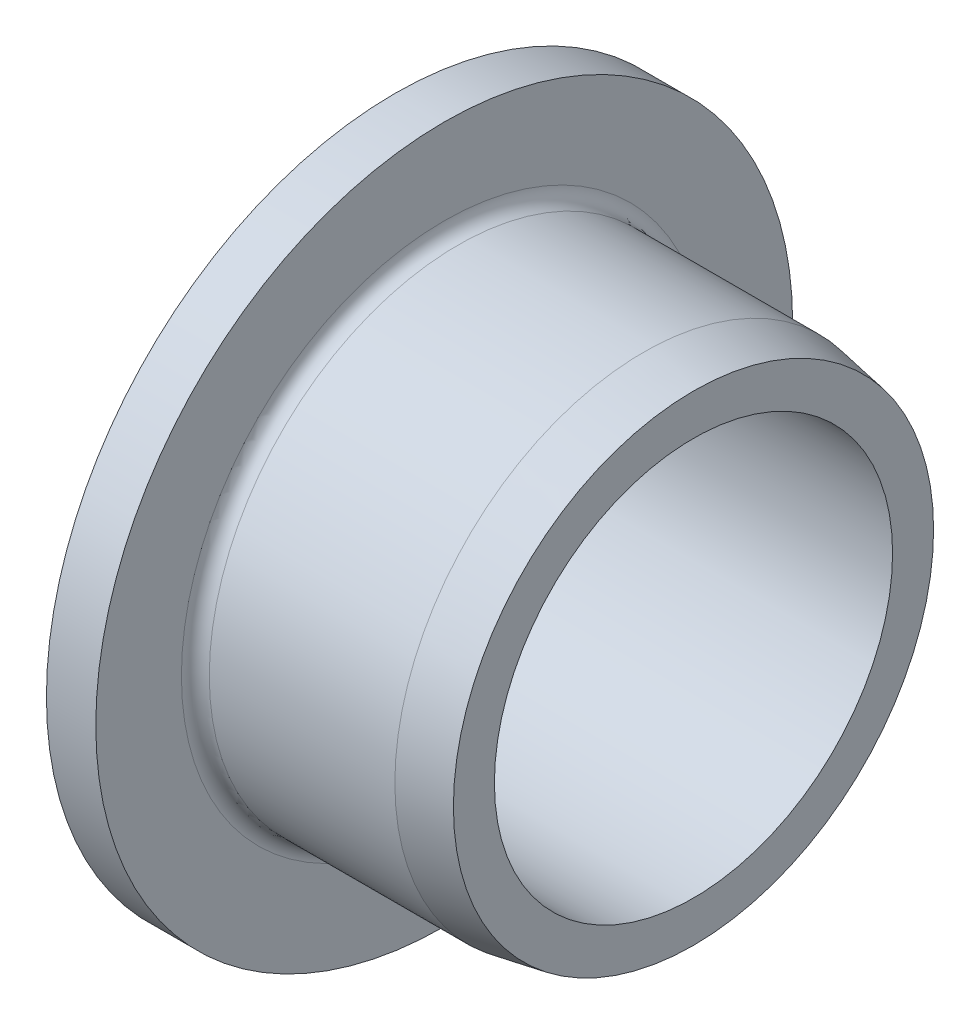
ISO-10303-21;
HEADER;
FILE_DESCRIPTION(('STEP AP214'),'2;1');
FILE_NAME('part.step','',(''),(''),'','','');
FILE_SCHEMA(('AUTOMOTIVE_DESIGN { 1 0 10303 214 1 1 1 1 }'));
ENDSEC;
DATA;
#1=APPLICATION_CONTEXT('core data for automotive mechanical design processes');
#2=APPLICATION_PROTOCOL_DEFINITION('international standard','automotive_design',2000,#1);
#3=PRODUCT_CONTEXT('',#1,'mechanical');
#4=PRODUCT('Part','Part','',(#3));
#5=PRODUCT_RELATED_PRODUCT_CATEGORY('part','',(#4));
#6=PRODUCT_DEFINITION_FORMATION('','',#4);
#7=PRODUCT_DEFINITION_CONTEXT('part definition',#1,'design');
#8=PRODUCT_DEFINITION('design','',#6,#7);
#9=PRODUCT_DEFINITION_SHAPE('','',#8);
#10=(LENGTH_UNIT() NAMED_UNIT(*) SI_UNIT(.MILLI.,.METRE.));
#11=(NAMED_UNIT(*) PLANE_ANGLE_UNIT() SI_UNIT($,.RADIAN.));
#12=(NAMED_UNIT(*) SI_UNIT($,.STERADIAN.) SOLID_ANGLE_UNIT());
#13=UNCERTAINTY_MEASURE_WITH_UNIT(LENGTH_MEASURE(1.E-05),#10,'distance_accuracy_value','');
#14=(GEOMETRIC_REPRESENTATION_CONTEXT(3) GLOBAL_UNCERTAINTY_ASSIGNED_CONTEXT((#13)) GLOBAL_UNIT_ASSIGNED_CONTEXT((#10,
#11,#12)) REPRESENTATION_CONTEXT('',''));
#15=CARTESIAN_POINT('',(0.,0.,0.));
#16=DIRECTION('',(0.,0.,1.));
#17=DIRECTION('',(1.,0.,0.));
#18=AXIS2_PLACEMENT_3D('',#15,#16,#17);
#19=CARTESIAN_POINT('',(6.34999999999999,0.,0.));
#20=DIRECTION('',(-1.,0.,0.));
#21=DIRECTION('',(0.,0.,1.));
#22=AXIS2_PLACEMENT_3D('',#19,#20,#21);
#23=CYLINDRICAL_SURFACE('',#22,7.9375);
#24=CARTESIAN_POINT('',(7.93749999999996,0.,0.));
#25=DIRECTION('',(-1.,0.,0.));
#26=DIRECTION('',(0.,0.,1.));
#27=AXIS2_PLACEMENT_3D('',#24,#25,#26);
#28=CIRCLE('',#27,7.9375);
#29=CARTESIAN_POINT('',(7.93749999999995,0.,7.9375));
#30=VERTEX_POINT('',#29);
#31=EDGE_CURVE('E43',#30,#30,#28,.T.);
#32=ORIENTED_EDGE('',*,*,#31,.T.);
#33=EDGE_LOOP('',(#32));
#34=FACE_BOUND('',#33,.T.);
#35=CARTESIAN_POINT('',(2.0193,0.,0.));
#36=DIRECTION('',(1.,0.,0.));
#37=DIRECTION('',(0.,0.,-1.));
#38=AXIS2_PLACEMENT_3D('',#35,#36,#37);
#39=CIRCLE('',#38,7.9375);
#40=CARTESIAN_POINT('',(2.0193,0.,-7.9375));
#41=VERTEX_POINT('',#40);
#42=EDGE_CURVE('E86',#41,#41,#39,.T.);
#43=ORIENTED_EDGE('',*,*,#42,.T.);
#44=EDGE_LOOP('',(#43));
#45=FACE_BOUND('',#44,.T.);
#46=ADVANCED_FACE('F36',(#34,#45),#23,.T.);
#47=CARTESIAN_POINT('',(2.01930000000001,0.,0.));
#48=DIRECTION('',(1.,0.,0.));
#49=DIRECTION('',(0.,0.,-1.));
#50=AXIS2_PLACEMENT_3D('',#47,#48,#49);
#51=TOROIDAL_SURFACE('',#50,8.382,0.444499999999997);
#52=CARTESIAN_POINT('',(1.57480000000001,0.,0.));
#53=DIRECTION('',(1.,0.,0.));
#54=DIRECTION('',(0.,0.,-1.));
#55=AXIS2_PLACEMENT_3D('',#52,#53,#54);
#56=CIRCLE('',#55,8.382);
#57=CARTESIAN_POINT('',(1.5748,0.,-8.382));
#58=VERTEX_POINT('',#57);
#59=EDGE_CURVE('E57',#58,#58,#56,.F.);
#60=ORIENTED_EDGE('',*,*,#59,.F.);
#61=EDGE_LOOP('',(#60));
#62=FACE_BOUND('',#61,.T.);
#63=ORIENTED_EDGE('',*,*,#42,.F.);
#64=EDGE_LOOP('',(#63));
#65=FACE_BOUND('',#64,.T.);
#66=ADVANCED_FACE('F66',(#62,#65),#51,.F.);
#67=CARTESIAN_POINT('',(1.57479999999999,8.38200000000003,0.));
#68=DIRECTION('',(1.,0.,0.));
#69=DIRECTION('',(0.,0.,-1.));
#70=AXIS2_PLACEMENT_3D('',#67,#68,#69);
#71=PLANE('',#70);
#72=ORIENTED_EDGE('',*,*,#59,.T.);
#73=EDGE_LOOP('',(#72));
#74=FACE_BOUND('',#73,.T.);
#75=CARTESIAN_POINT('',(1.57479999999999,0.,0.));
#76=DIRECTION('',(-1.,0.,0.));
#77=DIRECTION('',(0.,0.,1.));
#78=AXIS2_PLACEMENT_3D('',#75,#76,#77);
#79=CIRCLE('',#78,11.1125);
#80=CARTESIAN_POINT('',(1.57479999999998,0.,11.1125));
#81=VERTEX_POINT('',#80);
#82=EDGE_CURVE('E54',#81,#81,#79,.T.);
#83=ORIENTED_EDGE('',*,*,#82,.F.);
#84=EDGE_LOOP('',(#83));
#85=FACE_BOUND('',#84,.T.);
#86=ADVANCED_FACE('F76',(#74,#85),#71,.T.);
#87=CARTESIAN_POINT('',(6.34999999999999,0.,0.));
#88=DIRECTION('',(-1.,0.,0.));
#89=DIRECTION('',(0.,0.,1.));
#90=AXIS2_PLACEMENT_3D('',#87,#88,#89);
#91=CYLINDRICAL_SURFACE('',#90,6.35);
#92=CARTESIAN_POINT('',(0.,0.,0.));
#93=DIRECTION('',(-1.,0.,0.));
#94=DIRECTION('',(0.,0.,1.));
#95=AXIS2_PLACEMENT_3D('',#92,#93,#94);
#96=CIRCLE('',#95,6.35);
#97=CARTESIAN_POINT('',(0.,0.,6.35));
#98=VERTEX_POINT('',#97);
#99=EDGE_CURVE('E51',#98,#98,#96,.F.);
#100=ORIENTED_EDGE('',*,*,#99,.F.);
#101=EDGE_LOOP('',(#100));
#102=FACE_BOUND('',#101,.T.);
#103=CARTESIAN_POINT('',(9.52500000000001,0.,0.));
#104=DIRECTION('',(-1.,0.,0.));
#105=DIRECTION('',(0.,0.,1.));
#106=AXIS2_PLACEMENT_3D('',#103,#104,#105);
#107=CIRCLE('',#106,6.35);
#108=CARTESIAN_POINT('',(9.525,0.,6.35));
#109=VERTEX_POINT('',#108);
#110=EDGE_CURVE('E88',#109,#109,#107,.T.);
#111=ORIENTED_EDGE('',*,*,#110,.F.);
#112=EDGE_LOOP('',(#111));
#113=FACE_BOUND('',#112,.T.);
#114=ADVANCED_FACE('F101',(#102,#113),#91,.F.);
#115=CARTESIAN_POINT('',(6.34999999999999,0.,0.));
#116=DIRECTION('',(-1.,0.,0.));
#117=DIRECTION('',(0.,0.,1.));
#118=AXIS2_PLACEMENT_3D('',#115,#116,#117);
#119=CYLINDRICAL_SURFACE('',#118,11.1125);
#120=ORIENTED_EDGE('',*,*,#82,.T.);
#121=EDGE_LOOP('',(#120));
#122=FACE_BOUND('',#121,.T.);
#123=CARTESIAN_POINT('',(0.,0.,0.));
#124=DIRECTION('',(-1.,0.,0.));
#125=DIRECTION('',(0.,0.,1.));
#126=AXIS2_PLACEMENT_3D('',#123,#124,#125);
#127=CIRCLE('',#126,11.1125);
#128=CARTESIAN_POINT('',(0.,0.,11.1125));
#129=VERTEX_POINT('',#128);
#130=EDGE_CURVE('E47',#129,#129,#127,.T.);
#131=ORIENTED_EDGE('',*,*,#130,.F.);
#132=EDGE_LOOP('',(#131));
#133=FACE_BOUND('',#132,.T.);
#134=ADVANCED_FACE('F104',(#122,#133),#119,.T.);
#135=CARTESIAN_POINT('',(0.,11.1125,0.));
#136=DIRECTION('',(-1.,0.,0.));
#137=DIRECTION('',(0.,0.,1.));
#138=AXIS2_PLACEMENT_3D('',#135,#136,#137);
#139=PLANE('',#138);
#140=ORIENTED_EDGE('',*,*,#130,.T.);
#141=EDGE_LOOP('',(#140));
#142=FACE_BOUND('',#141,.T.);
#143=ORIENTED_EDGE('',*,*,#99,.T.);
#144=EDGE_LOOP('',(#143));
#145=FACE_BOUND('',#144,.T.);
#146=ADVANCED_FACE('F107',(#142,#145),#139,.T.);
#147=CARTESIAN_POINT('',(9.52500000000001,0.,0.));
#148=DIRECTION('',(-1.,0.,0.));
#149=DIRECTION('',(0.,0.,1.));
#150=AXIS2_PLACEMENT_3D('',#147,#148,#149);
#151=PLANE('',#150);
#152=CARTESIAN_POINT('',(9.52500000000001,0.,0.));
#153=DIRECTION('',(-1.,0.,0.));
#154=DIRECTION('',(0.,0.,1.));
#155=AXIS2_PLACEMENT_3D('',#152,#153,#154);
#156=CIRCLE('',#155,7.65758091812531);
#157=CARTESIAN_POINT('',(9.525,0.,7.65758091812531));
#158=VERTEX_POINT('',#157);
#159=EDGE_CURVE('E10',#158,#158,#156,.F.);
#160=ORIENTED_EDGE('',*,*,#159,.T.);
#161=EDGE_LOOP('',(#160));
#162=FACE_BOUND('',#161,.T.);
#163=ORIENTED_EDGE('',*,*,#110,.T.);
#164=EDGE_LOOP('',(#163));
#165=FACE_BOUND('',#164,.T.);
#166=ADVANCED_FACE('F113',(#162,#165),#151,.F.);
#167=CARTESIAN_POINT('',(7.93749999999996,0.,0.));
#168=DIRECTION('',(-1.,0.,0.));
#169=DIRECTION('',(0.,0.,1.));
#170=AXIS2_PLACEMENT_3D('',#167,#168,#169);
#171=CONICAL_SURFACE('',#170,7.9375,0.17453292519943);
#172=ORIENTED_EDGE('',*,*,#159,.F.);
#173=EDGE_LOOP('',(#172));
#174=FACE_BOUND('',#173,.T.);
#175=ORIENTED_EDGE('',*,*,#31,.F.);
#176=EDGE_LOOP('',(#175));
#177=FACE_BOUND('',#176,.T.);
#178=ADVANCED_FACE('F38',(#174,#177),#171,.T.);
#179=CLOSED_SHELL('',(#46,#66,#86,#114,#134,#146,#166,#178));
#180=MANIFOLD_SOLID_BREP('B2',#179);
#181=ADVANCED_BREP_SHAPE_REPRESENTATION('',(#18,#180),#14);
#182=SHAPE_DEFINITION_REPRESENTATION(#9,#181);
ENDSEC;
END-ISO-10303-21;
